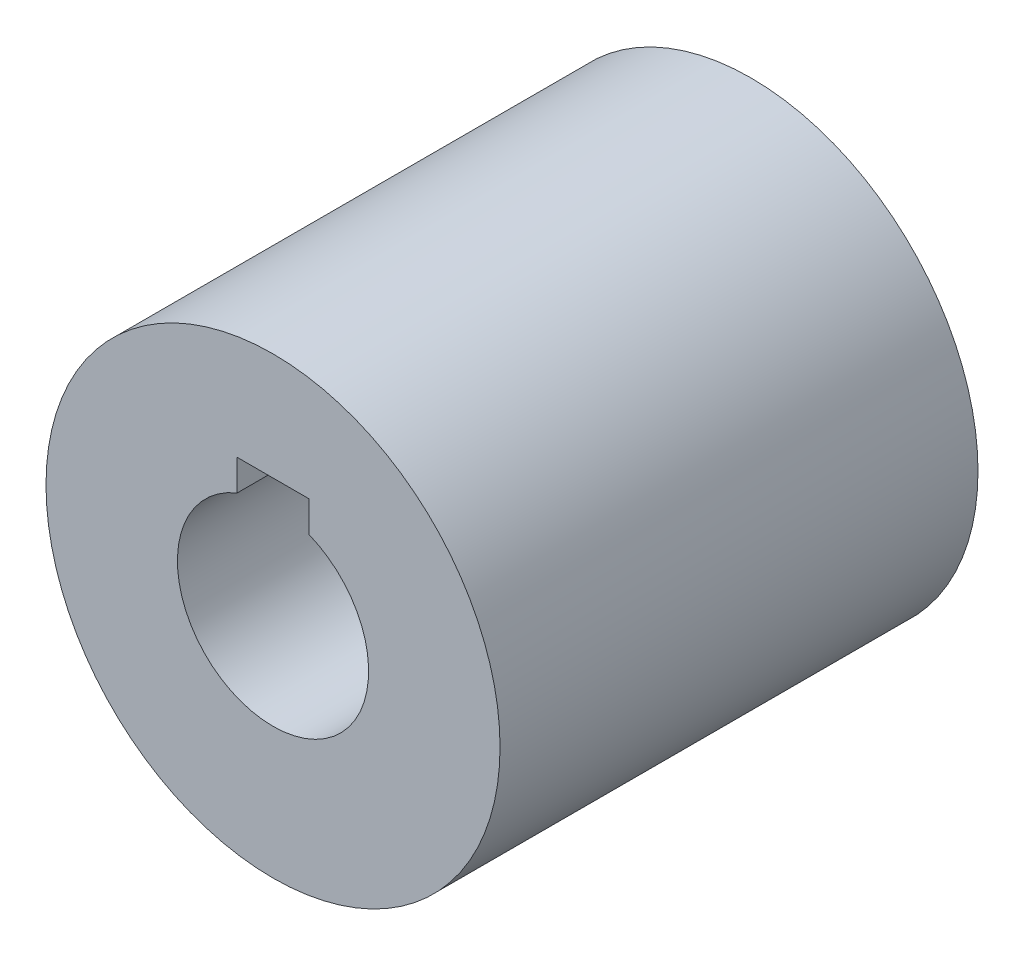
ISO-10303-21;
HEADER;
FILE_DESCRIPTION(('STEP AP214'),'2;1');
FILE_NAME('part.step','',(''),(''),'','','');
FILE_SCHEMA(('AUTOMOTIVE_DESIGN { 1 0 10303 214 1 1 1 1 }'));
ENDSEC;
DATA;
#1=APPLICATION_CONTEXT('core data for automotive mechanical design processes');
#2=APPLICATION_PROTOCOL_DEFINITION('international standard','automotive_design',2000,#1);
#3=PRODUCT_CONTEXT('',#1,'mechanical');
#4=PRODUCT('Part','Part','',(#3));
#5=PRODUCT_RELATED_PRODUCT_CATEGORY('part','',(#4));
#6=PRODUCT_DEFINITION_FORMATION('','',#4);
#7=PRODUCT_DEFINITION_CONTEXT('part definition',#1,'design');
#8=PRODUCT_DEFINITION('design','',#6,#7);
#9=PRODUCT_DEFINITION_SHAPE('','',#8);
#10=(LENGTH_UNIT() NAMED_UNIT(*) SI_UNIT(.MILLI.,.METRE.));
#11=(NAMED_UNIT(*) PLANE_ANGLE_UNIT() SI_UNIT($,.RADIAN.));
#12=(NAMED_UNIT(*) SI_UNIT($,.STERADIAN.) SOLID_ANGLE_UNIT());
#13=UNCERTAINTY_MEASURE_WITH_UNIT(LENGTH_MEASURE(1.E-05),#10,'distance_accuracy_value','');
#14=(GEOMETRIC_REPRESENTATION_CONTEXT(3) GLOBAL_UNCERTAINTY_ASSIGNED_CONTEXT((#13)) GLOBAL_UNIT_ASSIGNED_CONTEXT((#10,
#11,#12)) REPRESENTATION_CONTEXT('',''));
#15=CARTESIAN_POINT('',(0.,0.,0.));
#16=DIRECTION('',(0.,0.,1.));
#17=DIRECTION('',(1.,0.,0.));
#18=AXIS2_PLACEMENT_3D('',#15,#16,#17);
#19=CARTESIAN_POINT('',(0.,0.,20.));
#20=DIRECTION('',(0.,0.,1.));
#21=DIRECTION('',(1.,0.,0.));
#22=AXIS2_PLACEMENT_3D('',#19,#20,#21);
#23=PLANE('',#22);
#24=CARTESIAN_POINT('',(0.,0.,20.));
#25=DIRECTION('',(0.,0.,1.));
#26=DIRECTION('',(1.,0.,0.));
#27=AXIS2_PLACEMENT_3D('',#24,#25,#26);
#28=CIRCLE('',#27,9.5);
#29=CARTESIAN_POINT('',(9.5,0.,20.));
#30=VERTEX_POINT('',#29);
#31=EDGE_CURVE('E11',#30,#30,#28,.T.);
#32=ORIENTED_EDGE('',*,*,#31,.T.);
#33=EDGE_LOOP('',(#32));
#34=FACE_BOUND('',#33,.T.);
#35=DIRECTION('',(0.,1.,0.));
#36=VECTOR('',#35,1.);
#37=CARTESIAN_POINT('',(1.5,5.,20.));
#38=LINE('',#37,#36);
#39=CARTESIAN_POINT('',(1.5,3.70809924354783,20.));
#40=VERTEX_POINT('',#39);
#41=CARTESIAN_POINT('',(1.5,5.,20.));
#42=VERTEX_POINT('',#41);
#43=EDGE_CURVE('E96',#40,#42,#38,.T.);
#44=ORIENTED_EDGE('',*,*,#43,.F.);
#45=CARTESIAN_POINT('',(0.,0.,20.));
#46=DIRECTION('',(0.,0.,1.));
#47=DIRECTION('',(1.,0.,0.));
#48=AXIS2_PLACEMENT_3D('',#45,#46,#47);
#49=CIRCLE('',#48,4.);
#50=CARTESIAN_POINT('',(-1.5,3.70809924354783,20.));
#51=VERTEX_POINT('',#50);
#52=EDGE_CURVE('E87',#51,#40,#49,.T.);
#53=ORIENTED_EDGE('',*,*,#52,.F.);
#54=DIRECTION('',(0.,-1.,0.));
#55=VECTOR('',#54,1.);
#56=CARTESIAN_POINT('',(-1.5,3.70809924354783,20.));
#57=LINE('',#56,#55);
#58=CARTESIAN_POINT('',(-1.5,5.,20.));
#59=VERTEX_POINT('',#58);
#60=EDGE_CURVE('E112',#59,#51,#57,.T.);
#61=ORIENTED_EDGE('',*,*,#60,.F.);
#62=DIRECTION('',(-1.,0.,0.));
#63=VECTOR('',#62,1.);
#64=CARTESIAN_POINT('',(-1.5,5.,20.));
#65=LINE('',#64,#63);
#66=EDGE_CURVE('E108',#42,#59,#65,.T.);
#67=ORIENTED_EDGE('',*,*,#66,.F.);
#68=EDGE_LOOP('',(#44,#53,#61,#67));
#69=FACE_BOUND('',#68,.T.);
#70=ADVANCED_FACE('F45',(#34,#69),#23,.T.);
#71=CARTESIAN_POINT('',(0.,0.,0.));
#72=DIRECTION('',(0.,0.,1.));
#73=DIRECTION('',(1.,0.,0.));
#74=AXIS2_PLACEMENT_3D('',#71,#72,#73);
#75=PLANE('',#74);
#76=CARTESIAN_POINT('',(0.,0.,0.));
#77=DIRECTION('',(0.,0.,1.));
#78=DIRECTION('',(1.,0.,0.));
#79=AXIS2_PLACEMENT_3D('',#76,#77,#78);
#80=CIRCLE('',#79,9.5);
#81=CARTESIAN_POINT('',(9.5,0.,0.));
#82=VERTEX_POINT('',#81);
#83=EDGE_CURVE('E49',#82,#82,#80,.T.);
#84=ORIENTED_EDGE('',*,*,#83,.F.);
#85=EDGE_LOOP('',(#84));
#86=FACE_BOUND('',#85,.T.);
#87=CARTESIAN_POINT('',(0.,0.,0.));
#88=DIRECTION('',(0.,0.,1.));
#89=DIRECTION('',(1.,0.,0.));
#90=AXIS2_PLACEMENT_3D('',#87,#88,#89);
#91=CIRCLE('',#90,4.);
#92=CARTESIAN_POINT('',(-1.5,3.70809924354783,0.));
#93=VERTEX_POINT('',#92);
#94=CARTESIAN_POINT('',(1.5,3.70809924354783,0.));
#95=VERTEX_POINT('',#94);
#96=EDGE_CURVE('E69',#93,#95,#91,.T.);
#97=ORIENTED_EDGE('',*,*,#96,.T.);
#98=DIRECTION('',(0.,1.,0.));
#99=VECTOR('',#98,1.);
#100=CARTESIAN_POINT('',(1.5,5.,0.));
#101=LINE('',#100,#99);
#102=CARTESIAN_POINT('',(1.5,5.,0.));
#103=VERTEX_POINT('',#102);
#104=EDGE_CURVE('E103',#95,#103,#101,.T.);
#105=ORIENTED_EDGE('',*,*,#104,.T.);
#106=DIRECTION('',(-1.,0.,0.));
#107=VECTOR('',#106,1.);
#108=CARTESIAN_POINT('',(-1.5,5.,0.));
#109=LINE('',#108,#107);
#110=CARTESIAN_POINT('',(-1.5,5.,0.));
#111=VERTEX_POINT('',#110);
#112=EDGE_CURVE('E121',#103,#111,#109,.T.);
#113=ORIENTED_EDGE('',*,*,#112,.T.);
#114=DIRECTION('',(0.,-1.,0.));
#115=VECTOR('',#114,1.);
#116=CARTESIAN_POINT('',(-1.5,3.70809924354783,0.));
#117=LINE('',#116,#115);
#118=EDGE_CURVE('E97',#111,#93,#117,.T.);
#119=ORIENTED_EDGE('',*,*,#118,.T.);
#120=EDGE_LOOP('',(#97,#105,#113,#119));
#121=FACE_BOUND('',#120,.T.);
#122=ADVANCED_FACE('F137',(#86,#121),#75,.F.);
#123=CARTESIAN_POINT('',(0.,0.,20.));
#124=DIRECTION('',(0.,0.,-1.));
#125=DIRECTION('',(-1.,0.,0.));
#126=AXIS2_PLACEMENT_3D('',#123,#124,#125);
#127=CYLINDRICAL_SURFACE('',#126,9.5);
#128=ORIENTED_EDGE('',*,*,#31,.F.);
#129=EDGE_LOOP('',(#128));
#130=FACE_BOUND('',#129,.T.);
#131=ORIENTED_EDGE('',*,*,#83,.T.);
#132=EDGE_LOOP('',(#131));
#133=FACE_BOUND('',#132,.T.);
#134=ADVANCED_FACE('F47',(#130,#133),#127,.T.);
#135=CARTESIAN_POINT('',(0.,0.,20.));
#136=DIRECTION('',(0.,0.,-1.));
#137=DIRECTION('',(-1.,0.,0.));
#138=AXIS2_PLACEMENT_3D('',#135,#136,#137);
#139=CYLINDRICAL_SURFACE('',#138,4.);
#140=ORIENTED_EDGE('',*,*,#96,.F.);
#141=DIRECTION('',(0.,0.,-1.));
#142=VECTOR('',#141,1.);
#143=CARTESIAN_POINT('',(-1.5,3.70809924354783,20.));
#144=LINE('',#143,#142);
#145=EDGE_CURVE('E91',#51,#93,#144,.T.);
#146=ORIENTED_EDGE('',*,*,#145,.F.);
#147=ORIENTED_EDGE('',*,*,#52,.T.);
#148=DIRECTION('',(0.,0.,-1.));
#149=VECTOR('',#148,1.);
#150=CARTESIAN_POINT('',(1.5,3.70809924354783,20.));
#151=LINE('',#150,#149);
#152=EDGE_CURVE('E90',#40,#95,#151,.T.);
#153=ORIENTED_EDGE('',*,*,#152,.T.);
#154=EDGE_LOOP('',(#140,#146,#147,#153));
#155=FACE_BOUND('',#154,.T.);
#156=ADVANCED_FACE('F89',(#155),#139,.F.);
#157=CARTESIAN_POINT('',(1.5,5.,20.));
#158=DIRECTION('',(-1.,0.,0.));
#159=DIRECTION('',(0.,0.,1.));
#160=AXIS2_PLACEMENT_3D('',#157,#158,#159);
#161=PLANE('',#160);
#162=ORIENTED_EDGE('',*,*,#104,.F.);
#163=ORIENTED_EDGE('',*,*,#152,.F.);
#164=ORIENTED_EDGE('',*,*,#43,.T.);
#165=DIRECTION('',(0.,0.,-1.));
#166=VECTOR('',#165,1.);
#167=CARTESIAN_POINT('',(1.5,5.,20.));
#168=LINE('',#167,#166);
#169=EDGE_CURVE('E105',#42,#103,#168,.T.);
#170=ORIENTED_EDGE('',*,*,#169,.T.);
#171=EDGE_LOOP('',(#162,#163,#164,#170));
#172=FACE_BOUND('',#171,.T.);
#173=ADVANCED_FACE('F100',(#172),#161,.T.);
#174=CARTESIAN_POINT('',(-1.5,5.,20.));
#175=DIRECTION('',(0.,-1.,0.));
#176=DIRECTION('',(0.,0.,-1.));
#177=AXIS2_PLACEMENT_3D('',#174,#175,#176);
#178=PLANE('',#177);
#179=ORIENTED_EDGE('',*,*,#112,.F.);
#180=ORIENTED_EDGE('',*,*,#169,.F.);
#181=ORIENTED_EDGE('',*,*,#66,.T.);
#182=DIRECTION('',(0.,0.,-1.));
#183=VECTOR('',#182,1.);
#184=CARTESIAN_POINT('',(-1.5,5.,20.));
#185=LINE('',#184,#183);
#186=EDGE_CURVE('E61',#59,#111,#185,.T.);
#187=ORIENTED_EDGE('',*,*,#186,.T.);
#188=EDGE_LOOP('',(#179,#180,#181,#187));
#189=FACE_BOUND('',#188,.T.);
#190=ADVANCED_FACE('F135',(#189),#178,.T.);
#191=CARTESIAN_POINT('',(-1.5,3.70809924354783,20.));
#192=DIRECTION('',(1.,0.,0.));
#193=DIRECTION('',(0.,0.,-1.));
#194=AXIS2_PLACEMENT_3D('',#191,#192,#193);
#195=PLANE('',#194);
#196=ORIENTED_EDGE('',*,*,#118,.F.);
#197=ORIENTED_EDGE('',*,*,#186,.F.);
#198=ORIENTED_EDGE('',*,*,#60,.T.);
#199=ORIENTED_EDGE('',*,*,#145,.T.);
#200=EDGE_LOOP('',(#196,#197,#198,#199));
#201=FACE_BOUND('',#200,.T.);
#202=ADVANCED_FACE('F138',(#201),#195,.T.);
#203=CLOSED_SHELL('',(#70,#122,#134,#156,#173,#190,#202));
#204=MANIFOLD_SOLID_BREP('B2',#203);
#205=ADVANCED_BREP_SHAPE_REPRESENTATION('',(#18,#204),#14);
#206=SHAPE_DEFINITION_REPRESENTATION(#9,#205);
ENDSEC;
END-ISO-10303-21;
